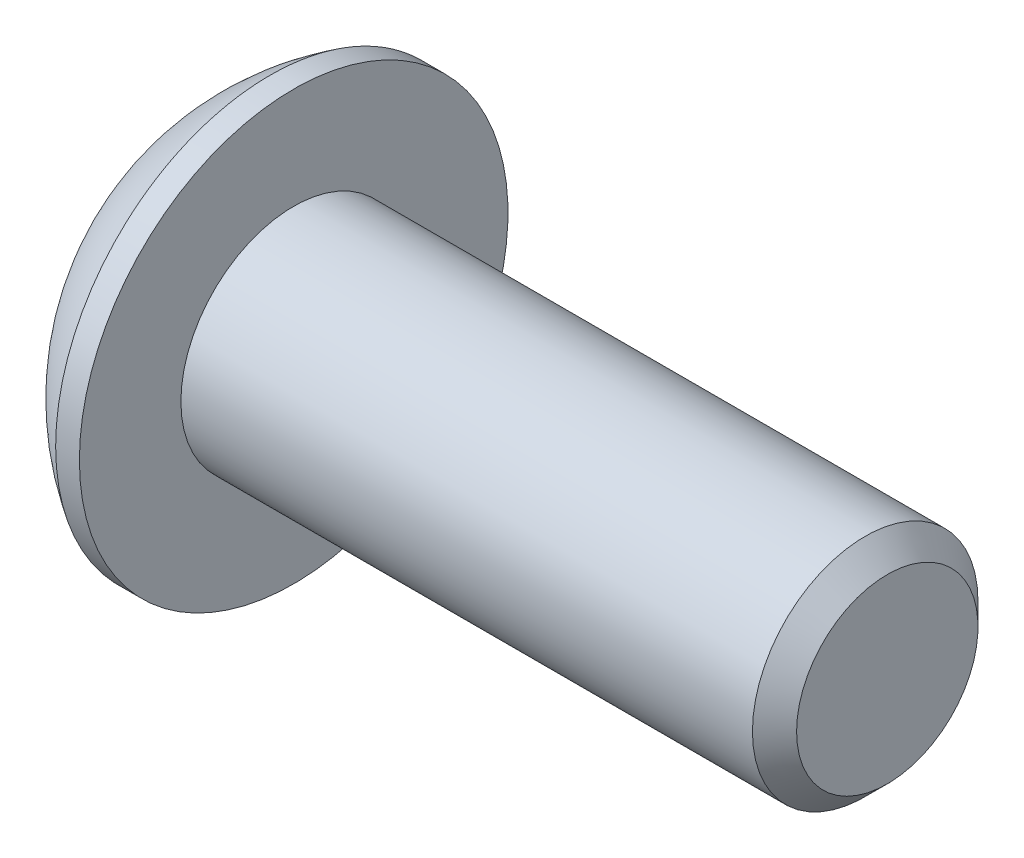
ISO-10303-21;
HEADER;
FILE_DESCRIPTION(('STEP AP214'),'2;1');
FILE_NAME('part.step','',(''),(''),'','','');
FILE_SCHEMA(('AUTOMOTIVE_DESIGN { 1 0 10303 214 1 1 1 1 }'));
ENDSEC;
DATA;
#1=APPLICATION_CONTEXT('core data for automotive mechanical design processes');
#2=APPLICATION_PROTOCOL_DEFINITION('international standard','automotive_design',2000,#1);
#3=PRODUCT_CONTEXT('',#1,'mechanical');
#4=PRODUCT('Part','Part','',(#3));
#5=PRODUCT_RELATED_PRODUCT_CATEGORY('part','',(#4));
#6=PRODUCT_DEFINITION_FORMATION('','',#4);
#7=PRODUCT_DEFINITION_CONTEXT('part definition',#1,'design');
#8=PRODUCT_DEFINITION('design','',#6,#7);
#9=PRODUCT_DEFINITION_SHAPE('','',#8);
#10=(LENGTH_UNIT() NAMED_UNIT(*) SI_UNIT(.MILLI.,.METRE.));
#11=(NAMED_UNIT(*) PLANE_ANGLE_UNIT() SI_UNIT($,.RADIAN.));
#12=(NAMED_UNIT(*) SI_UNIT($,.STERADIAN.) SOLID_ANGLE_UNIT());
#13=UNCERTAINTY_MEASURE_WITH_UNIT(LENGTH_MEASURE(1.E-05),#10,'distance_accuracy_value','');
#14=(GEOMETRIC_REPRESENTATION_CONTEXT(3) GLOBAL_UNCERTAINTY_ASSIGNED_CONTEXT((#13)) GLOBAL_UNIT_ASSIGNED_CONTEXT((#10,
#11,#12)) REPRESENTATION_CONTEXT('',''));
#15=CARTESIAN_POINT('',(0.,0.,0.));
#16=DIRECTION('',(0.,0.,1.));
#17=DIRECTION('',(1.,0.,0.));
#18=AXIS2_PLACEMENT_3D('',#15,#16,#17);
#19=CARTESIAN_POINT('',(1.77800000000017,0.,0.));
#20=DIRECTION('',(-1.,0.,0.));
#21=DIRECTION('',(0.,0.,1.));
#22=AXIS2_PLACEMENT_3D('',#19,#20,#21);
#23=CONICAL_SURFACE('',#22,1.58749999999985,1.04719755119662);
#24=CARTESIAN_POINT('',(2.69454355233856,0.,0.));
#25=VERTEX_POINT('',#24);
#26=VERTEX_LOOP('',#25);
#27=FACE_BOUND('',#26,.T.);
#28=CARTESIAN_POINT('',(1.77800000000017,0.,0.));
#29=DIRECTION('',(-1.,0.,0.));
#30=DIRECTION('',(0.,0.,1.));
#31=AXIS2_PLACEMENT_3D('',#28,#29,#30);
#32=CIRCLE('',#31,1.58749999999985);
#33=CARTESIAN_POINT('',(1.77800000000008,-1.37481532850773,0.793749999999965));
#34=VERTEX_POINT('',#33);
#35=CARTESIAN_POINT('',(1.77800000000008,0.,1.58749999999993));
#36=VERTEX_POINT('',#35);
#37=EDGE_CURVE('E21',#34,#36,#32,.T.);
#38=ORIENTED_EDGE('',*,*,#37,.T.);
#39=CARTESIAN_POINT('',(1.77800000000017,0.,0.));
#40=DIRECTION('',(-1.,0.,0.));
#41=DIRECTION('',(0.,0.,1.));
#42=AXIS2_PLACEMENT_3D('',#39,#40,#41);
#43=CIRCLE('',#42,1.58749999999985);
#44=CARTESIAN_POINT('',(1.77800000000008,1.37481532850773,0.793749999999963));
#45=VERTEX_POINT('',#44);
#46=EDGE_CURVE('E149',#36,#45,#43,.T.);
#47=ORIENTED_EDGE('',*,*,#46,.T.);
#48=CARTESIAN_POINT('',(1.77800000000017,0.,0.));
#49=DIRECTION('',(-1.,0.,0.));
#50=DIRECTION('',(0.,0.,1.));
#51=AXIS2_PLACEMENT_3D('',#48,#49,#50);
#52=CIRCLE('',#51,1.58749999999985);
#53=CARTESIAN_POINT('',(1.77800000000008,1.37481532850773,-0.793749999999963));
#54=VERTEX_POINT('',#53);
#55=EDGE_CURVE('E406',#45,#54,#52,.T.);
#56=ORIENTED_EDGE('',*,*,#55,.T.);
#57=CARTESIAN_POINT('',(1.77800000000017,0.,0.));
#58=DIRECTION('',(-1.,0.,0.));
#59=DIRECTION('',(0.,0.,1.));
#60=AXIS2_PLACEMENT_3D('',#57,#58,#59);
#61=CIRCLE('',#60,1.58749999999985);
#62=CARTESIAN_POINT('',(1.77800000000008,2.13833679173143E-12,-1.58749999999993));
#63=VERTEX_POINT('',#62);
#64=EDGE_CURVE('E407',#54,#63,#61,.T.);
#65=ORIENTED_EDGE('',*,*,#64,.T.);
#66=CARTESIAN_POINT('',(1.77800000000017,0.,0.));
#67=DIRECTION('',(-1.,0.,0.));
#68=DIRECTION('',(0.,0.,1.));
#69=AXIS2_PLACEMENT_3D('',#66,#67,#68);
#70=CIRCLE('',#69,1.58749999999985);
#71=CARTESIAN_POINT('',(1.77800000000008,-1.37481532850773,-0.793749999999965));
#72=VERTEX_POINT('',#71);
#73=EDGE_CURVE('E94',#63,#72,#70,.T.);
#74=ORIENTED_EDGE('',*,*,#73,.T.);
#75=CARTESIAN_POINT('',(1.77800000000017,0.,0.));
#76=DIRECTION('',(-1.,0.,0.));
#77=DIRECTION('',(0.,0.,1.));
#78=AXIS2_PLACEMENT_3D('',#75,#76,#77);
#79=CIRCLE('',#78,1.58749999999985);
#80=EDGE_CURVE('E90',#72,#34,#79,.T.);
#81=ORIENTED_EDGE('',*,*,#80,.T.);
#82=EDGE_LOOP('',(#38,#47,#56,#65,#74,#81));
#83=FACE_BOUND('',#82,.T.);
#84=ADVANCED_FACE('F18',(#27,#83),#23,.F.);
#85=CARTESIAN_POINT('',(1.778,-1.83308710467706,0.));
#86=DIRECTION('',(1.,0.,0.));
#87=DIRECTION('',(0.,0.,-1.));
#88=AXIS2_PLACEMENT_3D('',#85,#86,#87);
#89=PLANE('',#88);
#90=DIRECTION('',(0.,0.500000000000001,0.866025403784438));
#91=VECTOR('',#90,1.);
#92=CARTESIAN_POINT('',(1.778,-1.83308710467706,0.));
#93=LINE('',#92,#91);
#94=CARTESIAN_POINT('',(1.778,-0.91654355233853,1.5875));
#95=VERTEX_POINT('',#94);
#96=EDGE_CURVE('E102',#95,#34,#93,.F.);
#97=ORIENTED_EDGE('',*,*,#96,.F.);
#98=DIRECTION('',(0.,1.,0.));
#99=VECTOR('',#98,1.);
#100=CARTESIAN_POINT('',(1.778,-0.916543552338531,1.5875));
#101=LINE('',#100,#99);
#102=EDGE_CURVE('E104',#36,#95,#101,.F.);
#103=ORIENTED_EDGE('',*,*,#102,.F.);
#104=ORIENTED_EDGE('',*,*,#37,.F.);
#105=EDGE_LOOP('',(#97,#103,#104));
#106=FACE_BOUND('',#105,.T.);
#107=ADVANCED_FACE('F100',(#106),#89,.F.);
#108=CARTESIAN_POINT('',(1.778,-1.83308710467706,0.));
#109=DIRECTION('',(1.,0.,0.));
#110=DIRECTION('',(0.,0.,-1.));
#111=AXIS2_PLACEMENT_3D('',#108,#109,#110);
#112=PLANE('',#111);
#113=DIRECTION('',(0.,-0.500000000000001,0.866025403784438));
#114=VECTOR('',#113,1.);
#115=CARTESIAN_POINT('',(1.778,-0.916543552338531,-1.5875));
#116=LINE('',#115,#114);
#117=CARTESIAN_POINT('',(1.778,-1.83308710467706,0.));
#118=VERTEX_POINT('',#117);
#119=EDGE_CURVE('E110',#118,#72,#116,.F.);
#120=ORIENTED_EDGE('',*,*,#119,.F.);
#121=DIRECTION('',(0.,0.500000000000001,0.866025403784438));
#122=VECTOR('',#121,1.);
#123=CARTESIAN_POINT('',(1.778,-1.83308710467706,0.));
#124=LINE('',#123,#122);
#125=EDGE_CURVE('E107',#34,#118,#124,.F.);
#126=ORIENTED_EDGE('',*,*,#125,.F.);
#127=ORIENTED_EDGE('',*,*,#80,.F.);
#128=EDGE_LOOP('',(#120,#126,#127));
#129=FACE_BOUND('',#128,.T.);
#130=ADVANCED_FACE('F108',(#129),#112,.F.);
#131=CARTESIAN_POINT('',(1.778,-1.83308710467706,0.));
#132=DIRECTION('',(1.,0.,0.));
#133=DIRECTION('',(0.,0.,-1.));
#134=AXIS2_PLACEMENT_3D('',#131,#132,#133);
#135=PLANE('',#134);
#136=DIRECTION('',(0.,1.,0.));
#137=VECTOR('',#136,1.);
#138=CARTESIAN_POINT('',(1.778,0.91654355233853,-1.5875));
#139=LINE('',#138,#137);
#140=CARTESIAN_POINT('',(1.778,-0.916543552338531,-1.5875));
#141=VERTEX_POINT('',#140);
#142=EDGE_CURVE('E377',#141,#63,#139,.T.);
#143=ORIENTED_EDGE('',*,*,#142,.F.);
#144=DIRECTION('',(0.,-0.500000000000001,0.866025403784438));
#145=VECTOR('',#144,1.);
#146=CARTESIAN_POINT('',(1.778,-0.916543552338531,-1.5875));
#147=LINE('',#146,#145);
#148=EDGE_CURVE('E389',#72,#141,#147,.F.);
#149=ORIENTED_EDGE('',*,*,#148,.F.);
#150=ORIENTED_EDGE('',*,*,#73,.F.);
#151=EDGE_LOOP('',(#143,#149,#150));
#152=FACE_BOUND('',#151,.T.);
#153=ADVANCED_FACE('F192',(#152),#135,.F.);
#154=CARTESIAN_POINT('',(1.778,-1.83308710467706,0.));
#155=DIRECTION('',(1.,0.,0.));
#156=DIRECTION('',(0.,0.,-1.));
#157=AXIS2_PLACEMENT_3D('',#154,#155,#156);
#158=PLANE('',#157);
#159=DIRECTION('',(0.,-0.5,-0.866025403784439));
#160=VECTOR('',#159,1.);
#161=CARTESIAN_POINT('',(1.778,1.83308710467706,0.));
#162=LINE('',#161,#160);
#163=CARTESIAN_POINT('',(1.778,0.916543552338531,-1.5875));
#164=VERTEX_POINT('',#163);
#165=EDGE_CURVE('E363',#164,#54,#162,.F.);
#166=ORIENTED_EDGE('',*,*,#165,.F.);
#167=DIRECTION('',(0.,1.,0.));
#168=VECTOR('',#167,1.);
#169=CARTESIAN_POINT('',(1.778,0.91654355233853,-1.5875));
#170=LINE('',#169,#168);
#171=EDGE_CURVE('E374',#63,#164,#170,.T.);
#172=ORIENTED_EDGE('',*,*,#171,.F.);
#173=ORIENTED_EDGE('',*,*,#64,.F.);
#174=EDGE_LOOP('',(#166,#172,#173));
#175=FACE_BOUND('',#174,.T.);
#176=ADVANCED_FACE('F188',(#175),#158,.F.);
#177=CARTESIAN_POINT('',(1.778,-1.83308710467706,0.));
#178=DIRECTION('',(1.,0.,0.));
#179=DIRECTION('',(0.,0.,-1.));
#180=AXIS2_PLACEMENT_3D('',#177,#178,#179);
#181=PLANE('',#180);
#182=DIRECTION('',(0.,0.5,-0.866025403784439));
#183=VECTOR('',#182,1.);
#184=CARTESIAN_POINT('',(1.778,0.916543552338531,1.5875));
#185=LINE('',#184,#183);
#186=CARTESIAN_POINT('',(1.778,1.83308710467706,0.));
#187=VERTEX_POINT('',#186);
#188=EDGE_CURVE('E342',#187,#45,#185,.F.);
#189=ORIENTED_EDGE('',*,*,#188,.F.);
#190=DIRECTION('',(0.,-0.5,-0.866025403784439));
#191=VECTOR('',#190,1.);
#192=CARTESIAN_POINT('',(1.778,1.83308710467706,0.));
#193=LINE('',#192,#191);
#194=EDGE_CURVE('E361',#54,#187,#193,.F.);
#195=ORIENTED_EDGE('',*,*,#194,.F.);
#196=ORIENTED_EDGE('',*,*,#55,.F.);
#197=EDGE_LOOP('',(#189,#195,#196));
#198=FACE_BOUND('',#197,.T.);
#199=ADVANCED_FACE('F184',(#198),#181,.F.);
#200=CARTESIAN_POINT('',(1.778,-1.83308710467706,0.));
#201=DIRECTION('',(1.,0.,0.));
#202=DIRECTION('',(0.,0.,-1.));
#203=AXIS2_PLACEMENT_3D('',#200,#201,#202);
#204=PLANE('',#203);
#205=DIRECTION('',(0.,1.,0.));
#206=VECTOR('',#205,1.);
#207=CARTESIAN_POINT('',(1.778,-0.916543552338531,1.5875));
#208=LINE('',#207,#206);
#209=CARTESIAN_POINT('',(1.778,0.91654355233853,1.5875));
#210=VERTEX_POINT('',#209);
#211=EDGE_CURVE('E119',#210,#36,#208,.F.);
#212=ORIENTED_EDGE('',*,*,#211,.F.);
#213=DIRECTION('',(0.,0.5,-0.866025403784439));
#214=VECTOR('',#213,1.);
#215=CARTESIAN_POINT('',(1.778,0.916543552338531,1.5875));
#216=LINE('',#215,#214);
#217=EDGE_CURVE('E345',#45,#210,#216,.F.);
#218=ORIENTED_EDGE('',*,*,#217,.F.);
#219=ORIENTED_EDGE('',*,*,#46,.F.);
#220=EDGE_LOOP('',(#212,#218,#219));
#221=FACE_BOUND('',#220,.T.);
#222=ADVANCED_FACE('F180',(#221),#204,.F.);
#223=CARTESIAN_POINT('',(1.778,-0.916543552338531,1.5875));
#224=DIRECTION('',(0.,0.,-1.));
#225=DIRECTION('',(0.,1.,0.));
#226=AXIS2_PLACEMENT_3D('',#223,#224,#225);
#227=PLANE('',#226);
#228=DIRECTION('',(0.,1.,0.));
#229=VECTOR('',#228,1.);
#230=CARTESIAN_POINT('',(0.,0.,1.5875));
#231=LINE('',#230,#229);
#232=CARTESIAN_POINT('',(0.,0.91654355233853,1.5875));
#233=VERTEX_POINT('',#232);
#234=CARTESIAN_POINT('',(0.,-0.91654355233853,1.5875));
#235=VERTEX_POINT('',#234);
#236=EDGE_CURVE('E339',#233,#235,#231,.F.);
#237=ORIENTED_EDGE('',*,*,#236,.F.);
#238=DIRECTION('',(1.,0.,0.));
#239=VECTOR('',#238,1.);
#240=CARTESIAN_POINT('',(1.778,0.916543552338531,1.5875));
#241=LINE('',#240,#239);
#242=EDGE_CURVE('E351',#210,#233,#241,.F.);
#243=ORIENTED_EDGE('',*,*,#242,.F.);
#244=ORIENTED_EDGE('',*,*,#211,.T.);
#245=ORIENTED_EDGE('',*,*,#102,.T.);
#246=DIRECTION('',(1.,0.,0.));
#247=VECTOR('',#246,1.);
#248=CARTESIAN_POINT('',(1.778,-0.91654355233853,1.5875));
#249=LINE('',#248,#247);
#250=EDGE_CURVE('E113',#235,#95,#249,.T.);
#251=ORIENTED_EDGE('',*,*,#250,.F.);
#252=EDGE_LOOP('',(#237,#243,#244,#245,#251));
#253=FACE_BOUND('',#252,.T.);
#254=ADVANCED_FACE('F177',(#253),#227,.T.);
#255=CARTESIAN_POINT('',(1.778,-1.83308710467706,0.));
#256=DIRECTION('',(0.,0.866025403784438,-0.500000000000001));
#257=DIRECTION('',(0.,0.500000000000001,0.866025403784438));
#258=AXIS2_PLACEMENT_3D('',#255,#256,#257);
#259=PLANE('',#258);
#260=DIRECTION('',(0.,-0.500000000000001,-0.866025403784438));
#261=VECTOR('',#260,1.);
#262=CARTESIAN_POINT('',(0.,-0.916543552338531,1.5875));
#263=LINE('',#262,#261);
#264=CARTESIAN_POINT('',(0.,-1.83308710467706,0.));
#265=VERTEX_POINT('',#264);
#266=EDGE_CURVE('E336',#235,#265,#263,.T.);
#267=ORIENTED_EDGE('',*,*,#266,.F.);
#268=ORIENTED_EDGE('',*,*,#250,.T.);
#269=ORIENTED_EDGE('',*,*,#96,.T.);
#270=ORIENTED_EDGE('',*,*,#125,.T.);
#271=DIRECTION('',(1.,0.,0.));
#272=VECTOR('',#271,1.);
#273=CARTESIAN_POINT('',(1.778,-1.83308710467706,0.));
#274=LINE('',#273,#272);
#275=EDGE_CURVE('E386',#265,#118,#274,.T.);
#276=ORIENTED_EDGE('',*,*,#275,.F.);
#277=EDGE_LOOP('',(#267,#268,#269,#270,#276));
#278=FACE_BOUND('',#277,.T.);
#279=ADVANCED_FACE('F117',(#278),#259,.T.);
#280=CARTESIAN_POINT('',(1.778,-0.916543552338531,-1.5875));
#281=DIRECTION('',(0.,0.866025403784438,0.500000000000001));
#282=DIRECTION('',(0.,-0.500000000000001,0.866025403784438));
#283=AXIS2_PLACEMENT_3D('',#280,#281,#282);
#284=PLANE('',#283);
#285=DIRECTION('',(0.,0.500000000000001,-0.866025403784438));
#286=VECTOR('',#285,1.);
#287=CARTESIAN_POINT('',(0.,-1.83308710467706,0.));
#288=LINE('',#287,#286);
#289=CARTESIAN_POINT('',(0.,-0.916543552338531,-1.5875));
#290=VERTEX_POINT('',#289);
#291=EDGE_CURVE('E333',#265,#290,#288,.T.);
#292=ORIENTED_EDGE('',*,*,#291,.F.);
#293=ORIENTED_EDGE('',*,*,#275,.T.);
#294=ORIENTED_EDGE('',*,*,#119,.T.);
#295=ORIENTED_EDGE('',*,*,#148,.T.);
#296=DIRECTION('',(1.,0.,0.));
#297=VECTOR('',#296,1.);
#298=CARTESIAN_POINT('',(1.778,-0.916543552338531,-1.5875));
#299=LINE('',#298,#297);
#300=EDGE_CURVE('E371',#290,#141,#299,.T.);
#301=ORIENTED_EDGE('',*,*,#300,.F.);
#302=EDGE_LOOP('',(#292,#293,#294,#295,#301));
#303=FACE_BOUND('',#302,.T.);
#304=ADVANCED_FACE('F170',(#303),#284,.T.);
#305=CARTESIAN_POINT('',(1.778,0.91654355233853,-1.5875));
#306=DIRECTION('',(0.,0.,1.));
#307=DIRECTION('',(1.,0.,0.));
#308=AXIS2_PLACEMENT_3D('',#305,#306,#307);
#309=PLANE('',#308);
#310=DIRECTION('',(0.,1.,0.));
#311=VECTOR('',#310,1.);
#312=CARTESIAN_POINT('',(0.,0.,-1.5875));
#313=LINE('',#312,#311);
#314=CARTESIAN_POINT('',(0.,0.91654355233853,-1.5875));
#315=VERTEX_POINT('',#314);
#316=EDGE_CURVE('E330',#290,#315,#313,.T.);
#317=ORIENTED_EDGE('',*,*,#316,.F.);
#318=ORIENTED_EDGE('',*,*,#300,.T.);
#319=ORIENTED_EDGE('',*,*,#142,.T.);
#320=ORIENTED_EDGE('',*,*,#171,.T.);
#321=DIRECTION('',(1.,0.,0.));
#322=VECTOR('',#321,1.);
#323=CARTESIAN_POINT('',(1.778,0.91654355233853,-1.5875));
#324=LINE('',#323,#322);
#325=EDGE_CURVE('E346',#315,#164,#324,.T.);
#326=ORIENTED_EDGE('',*,*,#325,.F.);
#327=EDGE_LOOP('',(#317,#318,#319,#320,#326));
#328=FACE_BOUND('',#327,.T.);
#329=ADVANCED_FACE('F167',(#328),#309,.T.);
#330=CARTESIAN_POINT('',(1.778,1.83308710467706,0.));
#331=DIRECTION('',(0.,-0.866025403784439,0.5));
#332=DIRECTION('',(0.,-0.5,-0.866025403784439));
#333=AXIS2_PLACEMENT_3D('',#330,#331,#332);
#334=PLANE('',#333);
#335=DIRECTION('',(0.,0.5,0.866025403784439));
#336=VECTOR('',#335,1.);
#337=CARTESIAN_POINT('',(0.,0.91654355233853,-1.5875));
#338=LINE('',#337,#336);
#339=CARTESIAN_POINT('',(0.,1.83308710467706,0.));
#340=VERTEX_POINT('',#339);
#341=EDGE_CURVE('E327',#315,#340,#338,.T.);
#342=ORIENTED_EDGE('',*,*,#341,.F.);
#343=ORIENTED_EDGE('',*,*,#325,.T.);
#344=ORIENTED_EDGE('',*,*,#165,.T.);
#345=ORIENTED_EDGE('',*,*,#194,.T.);
#346=DIRECTION('',(1.,0.,0.));
#347=VECTOR('',#346,1.);
#348=CARTESIAN_POINT('',(1.778,1.83308710467706,0.));
#349=LINE('',#348,#347);
#350=EDGE_CURVE('E36',#340,#187,#349,.T.);
#351=ORIENTED_EDGE('',*,*,#350,.F.);
#352=EDGE_LOOP('',(#342,#343,#344,#345,#351));
#353=FACE_BOUND('',#352,.T.);
#354=ADVANCED_FACE('F163',(#353),#334,.T.);
#355=CARTESIAN_POINT('',(1.778,0.916543552338531,1.5875));
#356=DIRECTION('',(0.,-0.866025403784439,-0.5));
#357=DIRECTION('',(0.,0.5,-0.866025403784439));
#358=AXIS2_PLACEMENT_3D('',#355,#356,#357);
#359=PLANE('',#358);
#360=DIRECTION('',(0.,-0.5,0.866025403784439));
#361=VECTOR('',#360,1.);
#362=CARTESIAN_POINT('',(0.,1.83308710467706,0.));
#363=LINE('',#362,#361);
#364=EDGE_CURVE('E148',#340,#233,#363,.T.);
#365=ORIENTED_EDGE('',*,*,#364,.F.);
#366=ORIENTED_EDGE('',*,*,#350,.T.);
#367=ORIENTED_EDGE('',*,*,#188,.T.);
#368=ORIENTED_EDGE('',*,*,#217,.T.);
#369=ORIENTED_EDGE('',*,*,#242,.T.);
#370=EDGE_LOOP('',(#365,#366,#367,#368,#369));
#371=FACE_BOUND('',#370,.T.);
#372=ADVANCED_FACE('F159',(#371),#359,.T.);
#373=CARTESIAN_POINT('',(0.,0.,0.));
#374=DIRECTION('',(-1.,0.,0.));
#375=DIRECTION('',(0.,0.,1.));
#376=AXIS2_PLACEMENT_3D('',#373,#374,#375);
#377=PLANE('',#376);
#378=ORIENTED_EDGE('',*,*,#341,.T.);
#379=ORIENTED_EDGE('',*,*,#364,.T.);
#380=ORIENTED_EDGE('',*,*,#236,.T.);
#381=ORIENTED_EDGE('',*,*,#266,.T.);
#382=ORIENTED_EDGE('',*,*,#291,.T.);
#383=ORIENTED_EDGE('',*,*,#316,.T.);
#384=EDGE_LOOP('',(#378,#379,#380,#381,#382,#383));
#385=FACE_BOUND('',#384,.T.);
#386=CARTESIAN_POINT('',(0.,2.29235,0.));
#387=CARTESIAN_POINT('',(0.,2.29234961429956,0.0643619991867156));
#388=CARTESIAN_POINT('',(0.,2.28963695190107,0.128735826629365));
#389=CARTESIAN_POINT('',(0.,2.27880393843647,0.257038618985286));
#390=CARTESIAN_POINT('',(0.,2.27068199085126,0.320967446929162));
#391=CARTESIAN_POINT('',(0.,2.24906694794255,0.448021254607716));
#392=CARTESIAN_POINT('',(-2.10473483966727E-13,2.2355653265346,0.511144793381859));
#393=CARTESIAN_POINT('',(2.11512355009136E-13,2.20328400495643,0.636065176149319));
#394=CARTESIAN_POINT('',(7.88547714490058E-13,2.18450002159113,0.697860899533932));
#395=CARTESIAN_POINT('',(1.31038865418015E-12,2.12048422735802,0.880329802927745));
#396=CARTESIAN_POINT('',(0.,2.06753599079458,0.998391795928114));
#397=CARTESIAN_POINT('',(0.,1.94254204858672,1.22393765942147));
#398=CARTESIAN_POINT('',(1.0944863984612E-12,1.87049561696642,1.33142112758208));
#399=CARTESIAN_POINT('',(6.78157167000121E-13,1.7497425419488,1.48237719670935));
#400=CARTESIAN_POINT('',(1.81954057270124E-13,1.707345731323,1.53101280076737));
#401=CARTESIAN_POINT('',(-1.80911682549526E-13,1.61863910291528,1.62450601319184));
#402=CARTESIAN_POINT('',(0.,1.57233309727312,1.66936721890417));
#403=CARTESIAN_POINT('',(0.,1.47608431707233,1.7550488420402));
#404=CARTESIAN_POINT('',(0.,1.42613990458993,1.79586741981511));
#405=CARTESIAN_POINT('',(0.,1.3229945254125,1.87315615311522));
#406=CARTESIAN_POINT('',(0.,1.26979280714187,1.90962529930696));
#407=CARTESIAN_POINT('',(0.,1.10588180153952,2.01207722151089));
#408=CARTESIAN_POINT('',(0.,0.990764947001308,2.07119486286666));
#409=CARTESIAN_POINT('',(0.,0.752302198839713,2.16922858468855));
#410=CARTESIAN_POINT('',(0.,0.628956393121256,2.20814488091449));
#411=CARTESIAN_POINT('',(0.,0.377466101733266,2.26472755765919));
#412=CARTESIAN_POINT('',(0.,0.249321590440377,2.28239382469378));
#413=CARTESIAN_POINT('',(0.,-0.00811435371610854,2.29595665980955));
#414=CARTESIAN_POINT('',(0.,-0.137405786579706,2.29185322789072));
#415=CARTESIAN_POINT('',(0.,-0.393449386933725,2.26200962409059));
#416=CARTESIAN_POINT('',(0.,-0.520201567981082,2.23626956775766));
#417=CARTESIAN_POINT('',(0.,-0.767645294384449,2.16383549332686));
#418=CARTESIAN_POINT('',(0.,-0.888336774993553,2.11714125142684));
#419=CARTESIAN_POINT('',(0.,-1.06210572146656,2.03247976453653));
#420=CARTESIAN_POINT('',(0.,-1.11884498714066,2.00180278323694));
#421=CARTESIAN_POINT('',(0.,-1.22954062855573,1.93578011658035));
#422=CARTESIAN_POINT('',(0.,-1.28349764565393,1.9004355139425));
#423=CARTESIAN_POINT('',(0.,-1.38821676641538,1.82534174602347));
#424=CARTESIAN_POINT('',(0.,-1.43898030563029,1.78559458231503));
#425=CARTESIAN_POINT('',(0.,-1.53701984534431,1.70193996292361));
#426=CARTESIAN_POINT('',(0.,-1.58429243280551,1.65802852924126));
#427=CARTESIAN_POINT('',(0.,-1.72023903553758,1.52059650554138));
#428=CARTESIAN_POINT('',(0.,-1.80318066138239,1.42127847626519));
#429=CARTESIAN_POINT('',(0.,-1.95118232345098,1.21011519784663));
#430=CARTESIAN_POINT('',(0.,-2.01624303935584,1.09827042509272));
#431=CARTESIAN_POINT('',(0.,-2.09907772661315,0.923538238005834));
#432=CARTESIAN_POINT('',(0.,-2.12425103063558,0.864058373981962));
#433=CARTESIAN_POINT('',(0.,-2.16947990046565,0.743221562175597));
#434=CARTESIAN_POINT('',(0.,-2.18953960800684,0.681866178863361));
#435=CARTESIAN_POINT('',(0.,-2.22438542051156,0.557786972400354));
#436=CARTESIAN_POINT('',(0.,-2.23917985294818,0.495065478128169));
#437=CARTESIAN_POINT('',(0.,-2.26343456384453,0.368611258323513));
#438=CARTESIAN_POINT('',(0.,-2.27289641559286,0.304878836759567));
#439=CARTESIAN_POINT('',(0.,-2.28388649696736,0.200873029360624));
#440=CARTESIAN_POINT('',(0.,-2.28705930623293,0.160766164180097));
#441=CARTESIAN_POINT('',(0.,-2.29129117827044,0.0804410725432706));
#442=CARTESIAN_POINT('',(0.,-2.29235024104238,0.0402228460869713));
#443=CARTESIAN_POINT('',(0.,-2.29234961429957,-0.0643619991867166));
#444=CARTESIAN_POINT('',(0.,-2.28963695190107,-0.128735826629366));
#445=CARTESIAN_POINT('',(0.,-2.27880393843647,-0.257038618985287));
#446=CARTESIAN_POINT('',(0.,-2.27068199085126,-0.320967446929163));
#447=CARTESIAN_POINT('',(0.,-2.24906694794255,-0.448021254607718));
#448=CARTESIAN_POINT('',(-2.10776055808131E-13,-2.2355653265346,-0.511144793381862));
#449=CARTESIAN_POINT('',(2.11815172901383E-13,-2.20328400495643,-0.636065176149322));
#450=CARTESIAN_POINT('',(7.89841960011606E-13,-2.18450002159113,-0.697860899533935));
#451=CARTESIAN_POINT('',(1.31300223385862E-12,-2.12048422735802,-0.880329802927749));
#452=CARTESIAN_POINT('',(0.,-2.06753599079458,-0.998391795928116));
#453=CARTESIAN_POINT('',(0.,-1.94254204858672,-1.22393765942147));
#454=CARTESIAN_POINT('',(1.09190336088254E-12,-1.87049561696642,-1.33142112758208));
#455=CARTESIAN_POINT('',(6.76847156379684E-13,-1.74974254194879,-1.48237719670935));
#456=CARTESIAN_POINT('',(1.81603200486814E-13,-1.707345731323,-1.53101280076737));
#457=CARTESIAN_POINT('',(-1.80561164044999E-13,-1.61863910291528,-1.62450601319185));
#458=CARTESIAN_POINT('',(0.,-1.57233309727312,-1.66936721890417));
#459=CARTESIAN_POINT('',(0.,-1.47608431707233,-1.7550488420402));
#460=CARTESIAN_POINT('',(0.,-1.42613990458993,-1.79586741981511));
#461=CARTESIAN_POINT('',(0.,-1.3229945254125,-1.87315615311522));
#462=CARTESIAN_POINT('',(0.,-1.26979280714187,-1.90962529930697));
#463=CARTESIAN_POINT('',(0.,-1.10588180153952,-2.0120772215109));
#464=CARTESIAN_POINT('',(0.,-0.990764947001305,-2.07119486286666));
#465=CARTESIAN_POINT('',(0.,-0.752302198839709,-2.16922858468855));
#466=CARTESIAN_POINT('',(0.,-0.628956393121251,-2.20814488091449));
#467=CARTESIAN_POINT('',(0.,-0.377466101733262,-2.26472755765919));
#468=CARTESIAN_POINT('',(0.,-0.249321590440373,-2.28239382469378));
#469=CARTESIAN_POINT('',(0.,0.00811435371611301,-2.29595665980954));
#470=CARTESIAN_POINT('',(0.,0.13740578657971,-2.29185322789071));
#471=CARTESIAN_POINT('',(0.,0.393449386933729,-2.26200962409059));
#472=CARTESIAN_POINT('',(0.,0.520201567981087,-2.23626956775765));
#473=CARTESIAN_POINT('',(0.,0.767645294384454,-2.16383549332687));
#474=CARTESIAN_POINT('',(0.,0.888336774993558,-2.11714125142685));
#475=CARTESIAN_POINT('',(0.,1.06210572146656,-2.03247976453653));
#476=CARTESIAN_POINT('',(0.,1.11884498714067,-2.00180278323694));
#477=CARTESIAN_POINT('',(0.,1.22954062855573,-1.93578011658035));
#478=CARTESIAN_POINT('',(0.,1.28349764565393,-1.90043551394249));
#479=CARTESIAN_POINT('',(0.,1.38821676641538,-1.82534174602347));
#480=CARTESIAN_POINT('',(0.,1.43898030563029,-1.78559458231502));
#481=CARTESIAN_POINT('',(0.,1.53701984534431,-1.70193996292361));
#482=CARTESIAN_POINT('',(0.,1.58429243280551,-1.65802852924126));
#483=CARTESIAN_POINT('',(0.,1.72023903553758,-1.52059650554138));
#484=CARTESIAN_POINT('',(0.,1.80318066138239,-1.42127847626519));
#485=CARTESIAN_POINT('',(0.,1.95118232345098,-1.21011519784663));
#486=CARTESIAN_POINT('',(0.,2.01624303935584,-1.09827042509271));
#487=CARTESIAN_POINT('',(0.,2.09907772661314,-0.923538238005831));
#488=CARTESIAN_POINT('',(0.,2.12425103063558,-0.864058373981959));
#489=CARTESIAN_POINT('',(0.,2.16947990046565,-0.743221562175594));
#490=CARTESIAN_POINT('',(0.,2.18953960800684,-0.681866178863358));
#491=CARTESIAN_POINT('',(0.,2.22438542051156,-0.55778697240035));
#492=CARTESIAN_POINT('',(0.,2.23917985294818,-0.495065478128167));
#493=CARTESIAN_POINT('',(0.,2.26343456384453,-0.368611258323511));
#494=CARTESIAN_POINT('',(0.,2.27289641559285,-0.304878836759565));
#495=CARTESIAN_POINT('',(0.,2.28388649696736,-0.200873029360621));
#496=CARTESIAN_POINT('',(0.,2.28705930623293,-0.160766164180095));
#497=CARTESIAN_POINT('',(0.,2.29129117827044,-0.0804410725432706));
#498=CARTESIAN_POINT('',(0.,2.29235024104238,-0.0402228460869719));
#499=CARTESIAN_POINT('',(0.,2.29235,0.));
#500=B_SPLINE_CURVE_WITH_KNOTS('',3,(#386,#387,#388,#389,#390,#391,#392,#393,#394,#395,#396,
#397,#398,#399,#400,#401,#402,#403,#404,#405,#406,#407,#408,#409,#410,#411,#412,#413,#414,#415,
#416,#417,#418,#419,#420,#421,#422,#423,#424,#425,#426,#427,#428,#429,#430,#431,#432,#433,#434,
#435,#436,#437,#438,#439,#440,#441,#442,#443,#444,#445,#446,#447,#448,#449,#450,#451,#452,#453,
#454,#455,#456,#457,#458,#459,#460,#461,#462,#463,#464,#465,#466,#467,#468,#469,#470,#471,#472,
#473,#474,#475,#476,#477,#478,#479,#480,#481,#482,#483,#484,#485,#486,#487,#488,#489,#490,#491,
#492,#493,#494,#495,#496,#497,#498,#499),.UNSPECIFIED.,.T.,.F.,(4,2,2,2,2,2,2,2,2,2,2,2,2,2,2,2,
2,2,2,2,2,2,2,2,2,2,2,2,2,2,2,2,2,2,2,2,2,2,2,2,2,2,2,2,2,2,2,2,2,2,2,2,2,2,2,2,4),(0.,
0.193048968618033,0.386154939782394,0.579568183995957,0.773138711491037,1.15935703864577,
1.54559004914644,1.73895960916368,1.93214273180063,2.12541336477221,2.31872876140888,
2.70495649282618,3.09118009906582,3.47740576789431,3.86363143672284,4.24985504296252,
4.63608277437978,4.82939817101618,5.02266880398747,5.21585192662418,5.40922148664121,
5.79545449714215,6.18167282429723,6.3752433517926,6.5686565960064,6.76176256717087,
6.95481153578906,7.0754569329192,7.19610233004935,7.38915129866738,7.58225726983174,
7.77567051404531,7.96924104154039,8.35545936869512,8.7416923791958,8.93506193921303,
9.12824506184998,9.32151569482156,9.51483109145823,9.90105882287553,10.2872824291152,
10.6735080979437,11.0597337667722,11.4459573730119,11.8321851044291,12.0255005010655,
12.2187711340368,12.4119542566735,12.6053238166906,12.9915568271915,13.3777751543466,
13.5713456818419,13.7647589260557,13.9578648972202,14.1509138658384,14.2715592629685,
14.3922046600987),.UNSPECIFIED.);
#501=CARTESIAN_POINT('',(0.,2.29235,0.));
#502=VERTEX_POINT('',#501);
#503=EDGE_CURVE('E141',#502,#502,#500,.T.);
#504=ORIENTED_EDGE('',*,*,#503,.F.);
#505=EDGE_LOOP('',(#504));
#506=FACE_BOUND('',#505,.T.);
#507=ADVANCED_FACE('F155',(#385,#506),#377,.T.);
#508=CARTESIAN_POINT('',(4.85989606481482,0.,0.));
#509=DIRECTION('',(0.,1.,0.));
#510=DIRECTION('',(1.,0.,0.));
#511=AXIS2_PLACEMENT_3D('',#508,#509,#510);
#512=SPHERICAL_SURFACE('',#511,5.37340285883187);
#513=CARTESIAN_POINT('',(2.0574,0.,0.));
#514=DIRECTION('',(-1.,0.,0.));
#515=DIRECTION('',(0.,0.,1.));
#516=AXIS2_PLACEMENT_3D('',#513,#514,#515);
#517=CIRCLE('',#516,4.5847);
#518=CARTESIAN_POINT('',(2.0574,0.,4.5847));
#519=VERTEX_POINT('',#518);
#520=EDGE_CURVE('E138',#519,#519,#517,.F.);
#521=ORIENTED_EDGE('',*,*,#520,.F.);
#522=EDGE_LOOP('',(#521));
#523=FACE_BOUND('',#522,.T.);
#524=ORIENTED_EDGE('',*,*,#503,.T.);
#525=EDGE_LOOP('',(#524));
#526=FACE_BOUND('',#525,.T.);
#527=ADVANCED_FACE('F151',(#523,#526),#512,.T.);
#528=CARTESIAN_POINT('',(15.2654,0.,0.));
#529=DIRECTION('',(-1.,0.,0.));
#530=DIRECTION('',(0.,0.,1.));
#531=AXIS2_PLACEMENT_3D('',#528,#529,#530);
#532=PLANE('',#531);
#533=CARTESIAN_POINT('',(15.2653999999757,0.,0.));
#534=DIRECTION('',(-1.,0.,0.));
#535=DIRECTION('',(0.,0.,1.));
#536=AXIS2_PLACEMENT_3D('',#533,#534,#535);
#537=CIRCLE('',#536,1.94055999992315);
#538=CARTESIAN_POINT('',(15.2653999999757,0.,1.94055999992315));
#539=VERTEX_POINT('',#538);
#540=EDGE_CURVE('E135',#539,#539,#537,.T.);
#541=ORIENTED_EDGE('',*,*,#540,.F.);
#542=EDGE_LOOP('',(#541));
#543=FACE_BOUND('',#542,.T.);
#544=ADVANCED_FACE('F222',(#543),#532,.F.);
#545=CARTESIAN_POINT('',(0.,0.,0.));
#546=DIRECTION('',(-1.,0.,0.));
#547=DIRECTION('',(0.,0.,1.));
#548=AXIS2_PLACEMENT_3D('',#545,#546,#547);
#549=CYLINDRICAL_SURFACE('',#548,4.5847);
#550=ORIENTED_EDGE('',*,*,#520,.T.);
#551=EDGE_LOOP('',(#550));
#552=FACE_BOUND('',#551,.T.);
#553=CARTESIAN_POINT('',(2.5654,0.,0.));
#554=DIRECTION('',(-1.,0.,0.));
#555=DIRECTION('',(0.,0.,1.));
#556=AXIS2_PLACEMENT_3D('',#553,#554,#555);
#557=CIRCLE('',#556,4.5847);
#558=CARTESIAN_POINT('',(2.5654,0.,4.5847));
#559=VERTEX_POINT('',#558);
#560=EDGE_CURVE('E132',#559,#559,#557,.T.);
#561=ORIENTED_EDGE('',*,*,#560,.T.);
#562=EDGE_LOOP('',(#561));
#563=FACE_BOUND('',#562,.T.);
#564=ADVANCED_FACE('F219',(#552,#563),#549,.T.);
#565=CARTESIAN_POINT('',(14.7929599999657,0.,0.));
#566=DIRECTION('',(-1.,0.,0.));
#567=DIRECTION('',(0.,0.,1.));
#568=AXIS2_PLACEMENT_3D('',#565,#566,#567);
#569=CONICAL_SURFACE('',#568,2.41299999999001,0.785398163457608);
#570=CARTESIAN_POINT('',(14.79296,0.,0.));
#571=DIRECTION('',(-1.,0.,0.));
#572=DIRECTION('',(0.,0.,1.));
#573=AXIS2_PLACEMENT_3D('',#570,#571,#572);
#574=CIRCLE('',#573,2.413);
#575=CARTESIAN_POINT('',(14.79296,0.,2.413));
#576=VERTEX_POINT('',#575);
#577=EDGE_CURVE('E27',#576,#576,#574,.T.);
#578=ORIENTED_EDGE('',*,*,#577,.F.);
#579=EDGE_LOOP('',(#578));
#580=FACE_BOUND('',#579,.T.);
#581=ORIENTED_EDGE('',*,*,#540,.T.);
#582=EDGE_LOOP('',(#581));
#583=FACE_BOUND('',#582,.T.);
#584=ADVANCED_FACE('F212',(#580,#583),#569,.T.);
#585=CARTESIAN_POINT('',(2.5654,2.413,0.));
#586=DIRECTION('',(-1.,0.,0.));
#587=DIRECTION('',(0.,0.,1.));
#588=AXIS2_PLACEMENT_3D('',#585,#586,#587);
#589=PLANE('',#588);
#590=CARTESIAN_POINT('',(2.5654,0.,0.));
#591=DIRECTION('',(-1.,0.,0.));
#592=DIRECTION('',(0.,0.,1.));
#593=AXIS2_PLACEMENT_3D('',#590,#591,#592);
#594=CIRCLE('',#593,2.413);
#595=CARTESIAN_POINT('',(2.5654,0.,2.413));
#596=VERTEX_POINT('',#595);
#597=EDGE_CURVE('E11',#596,#596,#594,.F.);
#598=ORIENTED_EDGE('',*,*,#597,.F.);
#599=EDGE_LOOP('',(#598));
#600=FACE_BOUND('',#599,.T.);
#601=ORIENTED_EDGE('',*,*,#560,.F.);
#602=EDGE_LOOP('',(#601));
#603=FACE_BOUND('',#602,.T.);
#604=ADVANCED_FACE('F206',(#600,#603),#589,.F.);
#605=CARTESIAN_POINT('',(0.,0.,0.));
#606=DIRECTION('',(-1.,0.,0.));
#607=DIRECTION('',(0.,0.,1.));
#608=AXIS2_PLACEMENT_3D('',#605,#606,#607);
#609=CYLINDRICAL_SURFACE('',#608,2.413);
#610=ORIENTED_EDGE('',*,*,#597,.T.);
#611=EDGE_LOOP('',(#610));
#612=FACE_BOUND('',#611,.T.);
#613=ORIENTED_EDGE('',*,*,#577,.T.);
#614=EDGE_LOOP('',(#613));
#615=FACE_BOUND('',#614,.T.);
#616=ADVANCED_FACE('F204',(#612,#615),#609,.T.);
#617=CLOSED_SHELL('',(#84,#107,#130,#153,#176,#199,#222,#254,#279,#304,#329,#354,#372,#507,#527,
#544,#564,#584,#604,#616));
#618=MANIFOLD_SOLID_BREP('B1',#617);
#619=ADVANCED_BREP_SHAPE_REPRESENTATION('',(#18,#618),#14);
#620=SHAPE_DEFINITION_REPRESENTATION(#9,#619);
ENDSEC;
END-ISO-10303-21;
